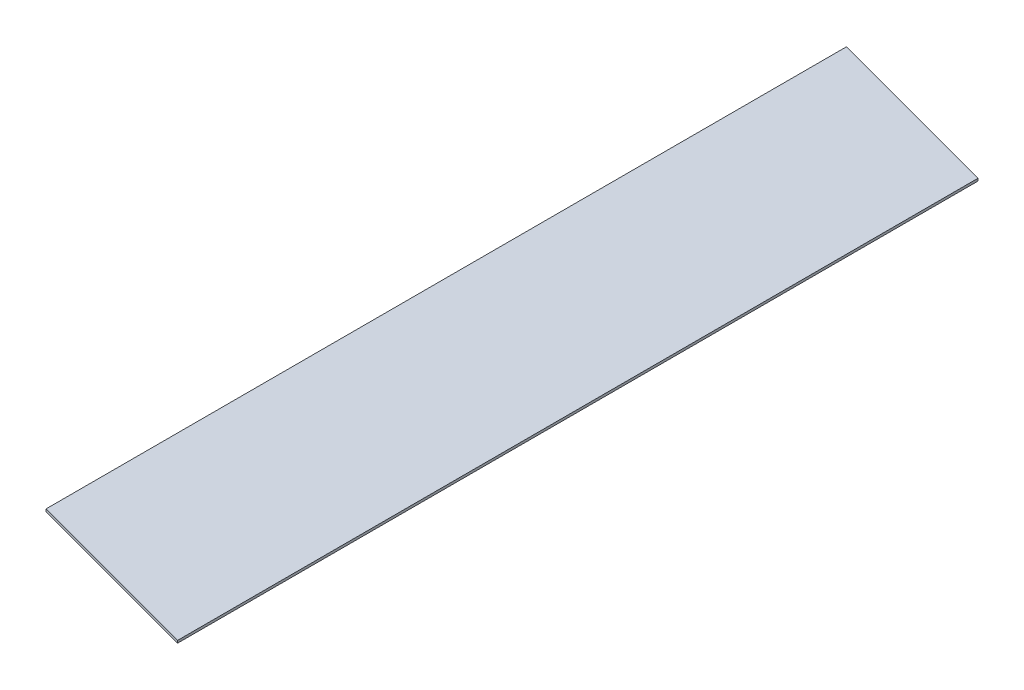
ISO-10303-21;
HEADER;
FILE_DESCRIPTION(('STEP AP214'),'2;1');
FILE_NAME('part.step','',(''),(''),'','','');
FILE_SCHEMA(('AUTOMOTIVE_DESIGN { 1 0 10303 214 1 1 1 1 }'));
ENDSEC;
DATA;
#1=APPLICATION_CONTEXT('core data for automotive mechanical design processes');
#2=APPLICATION_PROTOCOL_DEFINITION('international standard','automotive_design',2000,#1);
#3=PRODUCT_CONTEXT('',#1,'mechanical');
#4=PRODUCT('Part','Part','',(#3));
#5=PRODUCT_RELATED_PRODUCT_CATEGORY('part','',(#4));
#6=PRODUCT_DEFINITION_FORMATION('','',#4);
#7=PRODUCT_DEFINITION_CONTEXT('part definition',#1,'design');
#8=PRODUCT_DEFINITION('design','',#6,#7);
#9=PRODUCT_DEFINITION_SHAPE('','',#8);
#10=(LENGTH_UNIT() NAMED_UNIT(*) SI_UNIT(.MILLI.,.METRE.));
#11=(NAMED_UNIT(*) PLANE_ANGLE_UNIT() SI_UNIT($,.RADIAN.));
#12=(NAMED_UNIT(*) SI_UNIT($,.STERADIAN.) SOLID_ANGLE_UNIT());
#13=UNCERTAINTY_MEASURE_WITH_UNIT(LENGTH_MEASURE(1.E-05),#10,'distance_accuracy_value','');
#14=(GEOMETRIC_REPRESENTATION_CONTEXT(3) GLOBAL_UNCERTAINTY_ASSIGNED_CONTEXT((#13)) GLOBAL_UNIT_ASSIGNED_CONTEXT((#10,
#11,#12)) REPRESENTATION_CONTEXT('',''));
#15=CARTESIAN_POINT('',(0.,0.,0.));
#16=DIRECTION('',(0.,0.,1.));
#17=DIRECTION('',(1.,0.,0.));
#18=AXIS2_PLACEMENT_3D('',#15,#16,#17);
#19=CARTESIAN_POINT('',(-90.4487804878049,2.54,-82.5345121951219));
#20=DIRECTION('',(1.,0.,0.));
#21=DIRECTION('',(0.,0.,-1.));
#22=AXIS2_PLACEMENT_3D('',#19,#20,#21);
#23=PLANE('',#22);
#24=DIRECTION('',(0.,0.,1.));
#25=VECTOR('',#24,1.);
#26=CARTESIAN_POINT('',(-90.4487804878049,0.,-82.5345121951219));
#27=LINE('',#26,#25);
#28=CARTESIAN_POINT('',(-90.4487804878049,0.,-132.217651455699));
#29=VERTEX_POINT('',#28);
#30=CARTESIAN_POINT('',(-90.4487804878048,0.,694.0443485443));
#31=VERTEX_POINT('',#30);
#32=EDGE_CURVE('E112',#29,#31,#27,.T.);
#33=ORIENTED_EDGE('',*,*,#32,.T.);
#34=DIRECTION('',(0.,1.,0.));
#35=VECTOR('',#34,1.);
#36=CARTESIAN_POINT('',(-90.4487804878048,0.,694.044348544301));
#37=LINE('',#36,#35);
#38=CARTESIAN_POINT('',(-90.4487804878048,2.54,694.044348544301));
#39=VERTEX_POINT('',#38);
#40=EDGE_CURVE('E54',#31,#39,#37,.T.);
#41=ORIENTED_EDGE('',*,*,#40,.T.);
#42=DIRECTION('',(0.,0.,1.));
#43=VECTOR('',#42,1.);
#44=CARTESIAN_POINT('',(-90.4487804878049,2.54,-82.5345121951219));
#45=LINE('',#44,#43);
#46=CARTESIAN_POINT('',(-90.4487804878049,2.54,-132.217651455699));
#47=VERTEX_POINT('',#46);
#48=EDGE_CURVE('E82',#47,#39,#45,.T.);
#49=ORIENTED_EDGE('',*,*,#48,.F.);
#50=DIRECTION('',(0.,-1.,0.));
#51=VECTOR('',#50,1.);
#52=CARTESIAN_POINT('',(-90.4487804878049,2.54,-132.217651455699));
#53=LINE('',#52,#51);
#54=EDGE_CURVE('E85',#47,#29,#53,.T.);
#55=ORIENTED_EDGE('',*,*,#54,.T.);
#56=EDGE_LOOP('',(#33,#41,#49,#55));
#57=FACE_BOUND('',#56,.T.);
#58=ADVANCED_FACE('F39',(#57),#23,.F.);
#59=CARTESIAN_POINT('',(94.9712195121951,2.54,-82.5345121951219));
#60=DIRECTION('',(-1.,0.,0.));
#61=DIRECTION('',(0.,0.,1.));
#62=AXIS2_PLACEMENT_3D('',#59,#60,#61);
#63=PLANE('',#62);
#64=DIRECTION('',(0.,0.,-1.));
#65=VECTOR('',#64,1.);
#66=CARTESIAN_POINT('',(94.9712195121951,0.,-82.5345121951219));
#67=LINE('',#66,#65);
#68=CARTESIAN_POINT('',(94.9712195121952,0.,743.727487804878));
#69=VERTEX_POINT('',#68);
#70=CARTESIAN_POINT('',(94.9712195121951,0.,-82.5345121951219));
#71=VERTEX_POINT('',#70);
#72=EDGE_CURVE('E88',#69,#71,#67,.T.);
#73=ORIENTED_EDGE('',*,*,#72,.T.);
#74=DIRECTION('',(0.,-1.,0.));
#75=VECTOR('',#74,1.);
#76=CARTESIAN_POINT('',(94.9712195121951,2.54,-82.5345121951219));
#77=LINE('',#76,#75);
#78=CARTESIAN_POINT('',(94.9712195121951,2.54,-82.5345121951219));
#79=VERTEX_POINT('',#78);
#80=EDGE_CURVE('E47',#79,#71,#77,.T.);
#81=ORIENTED_EDGE('',*,*,#80,.F.);
#82=DIRECTION('',(0.,0.,-1.));
#83=VECTOR('',#82,1.);
#84=CARTESIAN_POINT('',(94.9712195121951,2.54,-82.5345121951219));
#85=LINE('',#84,#83);
#86=CARTESIAN_POINT('',(94.9712195121952,2.54,743.727487804878));
#87=VERTEX_POINT('',#86);
#88=EDGE_CURVE('E62',#87,#79,#85,.T.);
#89=ORIENTED_EDGE('',*,*,#88,.F.);
#90=DIRECTION('',(0.,-1.,0.));
#91=VECTOR('',#90,1.);
#92=CARTESIAN_POINT('',(94.9712195121952,2.54,743.727487804878));
#93=LINE('',#92,#91);
#94=EDGE_CURVE('E11',#87,#69,#93,.T.);
#95=ORIENTED_EDGE('',*,*,#94,.T.);
#96=EDGE_LOOP('',(#73,#81,#89,#95));
#97=FACE_BOUND('',#96,.T.);
#98=ADVANCED_FACE('F125',(#97),#63,.F.);
#99=CARTESIAN_POINT('',(0.,2.54,0.));
#100=DIRECTION('',(0.,1.,0.));
#101=DIRECTION('',(0.,0.,1.));
#102=AXIS2_PLACEMENT_3D('',#99,#100,#101);
#103=PLANE('',#102);
#104=DIRECTION('',(-0.96592582628907,0.,-0.258819045102515));
#105=VECTOR('',#104,1.);
#106=CARTESIAN_POINT('',(94.9712195121952,2.54,743.727487804878));
#107=LINE('',#106,#105);
#108=EDGE_CURVE('E98',#87,#39,#107,.T.);
#109=ORIENTED_EDGE('',*,*,#108,.F.);
#110=ORIENTED_EDGE('',*,*,#88,.T.);
#111=DIRECTION('',(0.96592582628907,0.,0.258819045102514));
#112=VECTOR('',#111,1.);
#113=CARTESIAN_POINT('',(-90.4487804878049,2.54,-132.217651455699));
#114=LINE('',#113,#112);
#115=EDGE_CURVE('E94',#47,#79,#114,.T.);
#116=ORIENTED_EDGE('',*,*,#115,.F.);
#117=ORIENTED_EDGE('',*,*,#48,.T.);
#118=EDGE_LOOP('',(#109,#110,#116,#117));
#119=FACE_BOUND('',#118,.T.);
#120=ADVANCED_FACE('F100',(#119),#103,.T.);
#121=CARTESIAN_POINT('',(0.,0.,0.));
#122=DIRECTION('',(0.,1.,0.));
#123=DIRECTION('',(0.,0.,1.));
#124=AXIS2_PLACEMENT_3D('',#121,#122,#123);
#125=PLANE('',#124);
#126=ORIENTED_EDGE('',*,*,#72,.F.);
#127=DIRECTION('',(-0.96592582628907,0.,-0.258819045102515));
#128=VECTOR('',#127,1.);
#129=CARTESIAN_POINT('',(94.9712195121952,0.,743.727487804878));
#130=LINE('',#129,#128);
#131=EDGE_CURVE('E106',#69,#31,#130,.T.);
#132=ORIENTED_EDGE('',*,*,#131,.T.);
#133=ORIENTED_EDGE('',*,*,#32,.F.);
#134=DIRECTION('',(0.96592582628907,0.,0.258819045102514));
#135=VECTOR('',#134,1.);
#136=CARTESIAN_POINT('',(-90.4487804878049,0.,-132.217651455699));
#137=LINE('',#136,#135);
#138=EDGE_CURVE('E96',#29,#71,#137,.T.);
#139=ORIENTED_EDGE('',*,*,#138,.T.);
#140=EDGE_LOOP('',(#126,#132,#133,#139));
#141=FACE_BOUND('',#140,.T.);
#142=ADVANCED_FACE('F123',(#141),#125,.F.);
#143=CARTESIAN_POINT('',(94.9712195121952,0.,743.727487804878));
#144=DIRECTION('',(0.258819045102515,0.,-0.96592582628907));
#145=DIRECTION('',(-0.96592582628907,0.,-0.258819045102515));
#146=AXIS2_PLACEMENT_3D('',#143,#144,#145);
#147=PLANE('',#146);
#148=ORIENTED_EDGE('',*,*,#108,.T.);
#149=ORIENTED_EDGE('',*,*,#40,.F.);
#150=ORIENTED_EDGE('',*,*,#131,.F.);
#151=ORIENTED_EDGE('',*,*,#94,.F.);
#152=EDGE_LOOP('',(#148,#149,#150,#151));
#153=FACE_BOUND('',#152,.T.);
#154=ADVANCED_FACE('F124',(#153),#147,.F.);
#155=CARTESIAN_POINT('',(-90.4487804878049,2.54,-132.217651455699));
#156=DIRECTION('',(0.258819045102514,0.,-0.96592582628907));
#157=DIRECTION('',(-0.96592582628907,0.,-0.258819045102514));
#158=AXIS2_PLACEMENT_3D('',#155,#156,#157);
#159=PLANE('',#158);
#160=ORIENTED_EDGE('',*,*,#138,.F.);
#161=ORIENTED_EDGE('',*,*,#54,.F.);
#162=ORIENTED_EDGE('',*,*,#115,.T.);
#163=ORIENTED_EDGE('',*,*,#80,.T.);
#164=EDGE_LOOP('',(#160,#161,#162,#163));
#165=FACE_BOUND('',#164,.T.);
#166=ADVANCED_FACE('F92',(#165),#159,.T.);
#167=CLOSED_SHELL('',(#58,#98,#120,#142,#154,#166));
#168=MANIFOLD_SOLID_BREP('B2',#167);
#169=ADVANCED_BREP_SHAPE_REPRESENTATION('',(#18,#168),#14);
#170=SHAPE_DEFINITION_REPRESENTATION(#9,#169);
ENDSEC;
END-ISO-10303-21;
